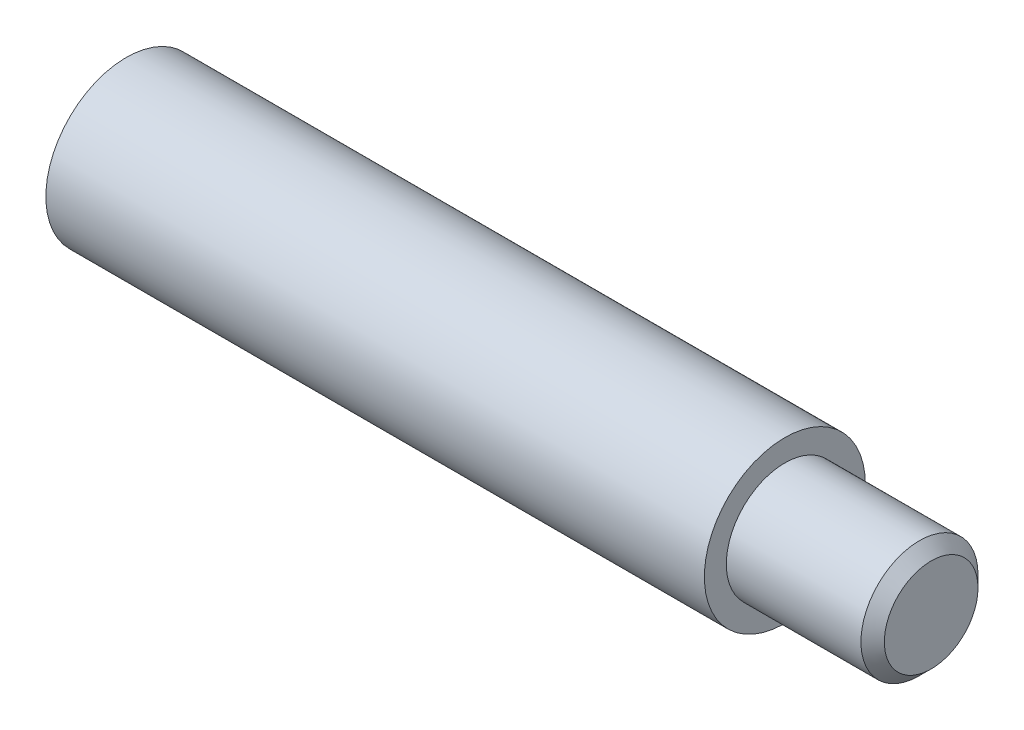
ISO-10303-21;
HEADER;
FILE_DESCRIPTION(('STEP AP214'),'2;1');
FILE_NAME('part.step','',(''),(''),'','','');
FILE_SCHEMA(('AUTOMOTIVE_DESIGN { 1 0 10303 214 1 1 1 1 }'));
ENDSEC;
DATA;
#1=APPLICATION_CONTEXT('core data for automotive mechanical design processes');
#2=APPLICATION_PROTOCOL_DEFINITION('international standard','automotive_design',2000,#1);
#3=PRODUCT_CONTEXT('',#1,'mechanical');
#4=PRODUCT('Part','Part','',(#3));
#5=PRODUCT_RELATED_PRODUCT_CATEGORY('part','',(#4));
#6=PRODUCT_DEFINITION_FORMATION('','',#4);
#7=PRODUCT_DEFINITION_CONTEXT('part definition',#1,'design');
#8=PRODUCT_DEFINITION('design','',#6,#7);
#9=PRODUCT_DEFINITION_SHAPE('','',#8);
#10=(LENGTH_UNIT() NAMED_UNIT(*) SI_UNIT(.MILLI.,.METRE.));
#11=(NAMED_UNIT(*) PLANE_ANGLE_UNIT() SI_UNIT($,.RADIAN.));
#12=(NAMED_UNIT(*) SI_UNIT($,.STERADIAN.) SOLID_ANGLE_UNIT());
#13=UNCERTAINTY_MEASURE_WITH_UNIT(LENGTH_MEASURE(1.E-05),#10,'distance_accuracy_value','');
#14=(GEOMETRIC_REPRESENTATION_CONTEXT(3) GLOBAL_UNCERTAINTY_ASSIGNED_CONTEXT((#13)) GLOBAL_UNIT_ASSIGNED_CONTEXT((#10,
#11,#12)) REPRESENTATION_CONTEXT('',''));
#15=CARTESIAN_POINT('',(0.,0.,0.));
#16=DIRECTION('',(0.,0.,1.));
#17=DIRECTION('',(1.,0.,0.));
#18=AXIS2_PLACEMENT_3D('',#15,#16,#17);
#19=CARTESIAN_POINT('',(-27.5,0.,0.));
#20=DIRECTION('',(1.,0.,0.));
#21=DIRECTION('',(0.,0.,-1.));
#22=AXIS2_PLACEMENT_3D('',#19,#20,#21);
#23=CYLINDRICAL_SURFACE('',#22,2.4585);
#24=CARTESIAN_POINT('',(-15.5,0.,0.));
#25=DIRECTION('',(1.,0.,0.));
#26=DIRECTION('',(0.,0.,-1.));
#27=AXIS2_PLACEMENT_3D('',#24,#25,#26);
#28=CIRCLE('',#27,2.4585);
#29=CARTESIAN_POINT('',(-15.5,0.,-2.4585));
#30=VERTEX_POINT('',#29);
#31=EDGE_CURVE('E11',#30,#30,#28,.T.);
#32=ORIENTED_EDGE('',*,*,#31,.T.);
#33=EDGE_LOOP('',(#32));
#34=FACE_BOUND('',#33,.T.);
#35=CARTESIAN_POINT('',(-26.7,0.,0.));
#36=DIRECTION('',(1.,0.,0.));
#37=DIRECTION('',(0.,0.,-1.));
#38=AXIS2_PLACEMENT_3D('',#35,#36,#37);
#39=CIRCLE('',#38,2.4585);
#40=CARTESIAN_POINT('',(-26.7,0.,-2.4585));
#41=VERTEX_POINT('',#40);
#42=EDGE_CURVE('E51',#41,#41,#39,.T.);
#43=ORIENTED_EDGE('',*,*,#42,.F.);
#44=EDGE_LOOP('',(#43));
#45=FACE_BOUND('',#44,.T.);
#46=ADVANCED_FACE('F32',(#34,#45),#23,.F.);
#47=CARTESIAN_POINT('',(-15.5,0.,0.));
#48=DIRECTION('',(-1.,0.,0.));
#49=DIRECTION('',(0.,0.,1.));
#50=AXIS2_PLACEMENT_3D('',#47,#48,#49);
#51=CONICAL_SURFACE('',#50,2.4585,1.02974425864057);
#52=CARTESIAN_POINT('',(-14.022784168,0.,0.));
#53=VERTEX_POINT('',#52);
#54=VERTEX_LOOP('',#53);
#55=FACE_BOUND('',#54,.T.);
#56=ORIENTED_EDGE('',*,*,#31,.F.);
#57=EDGE_LOOP('',(#56));
#58=FACE_BOUND('',#57,.T.);
#59=ADVANCED_FACE('F41',(#55,#58),#51,.F.);
#60=CARTESIAN_POINT('',(27.5,0.,0.));
#61=DIRECTION('',(1.,0.,0.));
#62=DIRECTION('',(0.,0.,-1.));
#63=AXIS2_PLACEMENT_3D('',#60,#61,#62);
#64=PLANE('',#63);
#65=CARTESIAN_POINT('',(27.5,0.,0.));
#66=DIRECTION('',(1.,0.,0.));
#67=DIRECTION('',(0.,0.,-1.));
#68=AXIS2_PLACEMENT_3D('',#65,#66,#67);
#69=CIRCLE('',#68,3.2);
#70=CARTESIAN_POINT('',(27.5,0.,-3.2));
#71=VERTEX_POINT('',#70);
#72=EDGE_CURVE('E38',#71,#71,#69,.T.);
#73=ORIENTED_EDGE('',*,*,#72,.T.);
#74=EDGE_LOOP('',(#73));
#75=FACE_BOUND('',#74,.T.);
#76=ADVANCED_FACE('F44',(#75),#64,.T.);
#77=CARTESIAN_POINT('',(27.5,0.,0.));
#78=DIRECTION('',(-1.,0.,0.));
#79=DIRECTION('',(0.,0.,1.));
#80=AXIS2_PLACEMENT_3D('',#77,#78,#79);
#81=CONICAL_SURFACE('',#80,3.2,0.785398163397451);
#82=CARTESIAN_POINT('',(26.7,0.,0.));
#83=DIRECTION('',(1.,0.,0.));
#84=DIRECTION('',(0.,0.,-1.));
#85=AXIS2_PLACEMENT_3D('',#82,#83,#84);
#86=CIRCLE('',#85,4.);
#87=CARTESIAN_POINT('',(26.7,0.,-4.));
#88=VERTEX_POINT('',#87);
#89=EDGE_CURVE('E67',#88,#88,#86,.T.);
#90=ORIENTED_EDGE('',*,*,#89,.T.);
#91=EDGE_LOOP('',(#90));
#92=FACE_BOUND('',#91,.T.);
#93=ORIENTED_EDGE('',*,*,#72,.F.);
#94=EDGE_LOOP('',(#93));
#95=FACE_BOUND('',#94,.T.);
#96=ADVANCED_FACE('F73',(#92,#95),#81,.T.);
#97=CARTESIAN_POINT('',(-27.5,0.,0.));
#98=DIRECTION('',(1.,0.,0.));
#99=DIRECTION('',(0.,0.,-1.));
#100=AXIS2_PLACEMENT_3D('',#97,#98,#99);
#101=CYLINDRICAL_SURFACE('',#100,4.);
#102=CARTESIAN_POINT('',(17.5,0.,0.));
#103=DIRECTION('',(1.,0.,0.));
#104=DIRECTION('',(0.,0.,-1.));
#105=AXIS2_PLACEMENT_3D('',#102,#103,#104);
#106=CIRCLE('',#105,4.);
#107=CARTESIAN_POINT('',(17.5,0.,-4.));
#108=VERTEX_POINT('',#107);
#109=EDGE_CURVE('E64',#108,#108,#106,.T.);
#110=ORIENTED_EDGE('',*,*,#109,.T.);
#111=EDGE_LOOP('',(#110));
#112=FACE_BOUND('',#111,.T.);
#113=ORIENTED_EDGE('',*,*,#89,.F.);
#114=EDGE_LOOP('',(#113));
#115=FACE_BOUND('',#114,.T.);
#116=ADVANCED_FACE('F75',(#112,#115),#101,.T.);
#117=CARTESIAN_POINT('',(17.5,4.,0.));
#118=DIRECTION('',(1.,0.,0.));
#119=DIRECTION('',(0.,0.,-1.));
#120=AXIS2_PLACEMENT_3D('',#117,#118,#119);
#121=PLANE('',#120);
#122=CARTESIAN_POINT('',(17.5,0.,0.));
#123=DIRECTION('',(1.,0.,0.));
#124=DIRECTION('',(0.,0.,-1.));
#125=AXIS2_PLACEMENT_3D('',#122,#123,#124);
#126=CIRCLE('',#125,5.5);
#127=CARTESIAN_POINT('',(17.5,0.,-5.5));
#128=VERTEX_POINT('',#127);
#129=EDGE_CURVE('E61',#128,#128,#126,.T.);
#130=ORIENTED_EDGE('',*,*,#129,.T.);
#131=EDGE_LOOP('',(#130));
#132=FACE_BOUND('',#131,.T.);
#133=ORIENTED_EDGE('',*,*,#109,.F.);
#134=EDGE_LOOP('',(#133));
#135=FACE_BOUND('',#134,.T.);
#136=ADVANCED_FACE('F82',(#132,#135),#121,.T.);
#137=CARTESIAN_POINT('',(-27.5,0.,0.));
#138=DIRECTION('',(1.,0.,0.));
#139=DIRECTION('',(0.,0.,-1.));
#140=AXIS2_PLACEMENT_3D('',#137,#138,#139);
#141=CYLINDRICAL_SURFACE('',#140,5.5);
#142=CARTESIAN_POINT('',(-27.5,0.,0.));
#143=DIRECTION('',(1.,0.,0.));
#144=DIRECTION('',(0.,0.,-1.));
#145=AXIS2_PLACEMENT_3D('',#142,#143,#144);
#146=CIRCLE('',#145,5.5);
#147=CARTESIAN_POINT('',(-27.5,0.,-5.5));
#148=VERTEX_POINT('',#147);
#149=EDGE_CURVE('E56',#148,#148,#146,.T.);
#150=ORIENTED_EDGE('',*,*,#149,.T.);
#151=EDGE_LOOP('',(#150));
#152=FACE_BOUND('',#151,.T.);
#153=ORIENTED_EDGE('',*,*,#129,.F.);
#154=EDGE_LOOP('',(#153));
#155=FACE_BOUND('',#154,.T.);
#156=ADVANCED_FACE('F89',(#152,#155),#141,.T.);
#157=CARTESIAN_POINT('',(-27.5,5.5,0.));
#158=DIRECTION('',(-1.,0.,0.));
#159=DIRECTION('',(0.,0.,1.));
#160=AXIS2_PLACEMENT_3D('',#157,#158,#159);
#161=PLANE('',#160);
#162=CARTESIAN_POINT('',(-27.5,0.,0.));
#163=DIRECTION('',(1.,0.,0.));
#164=DIRECTION('',(0.,0.,-1.));
#165=AXIS2_PLACEMENT_3D('',#162,#163,#164);
#166=CIRCLE('',#165,3.25849999999997);
#167=CARTESIAN_POINT('',(-27.5,0.,-3.25849999999997));
#168=VERTEX_POINT('',#167);
#169=EDGE_CURVE('E53',#168,#168,#166,.T.);
#170=ORIENTED_EDGE('',*,*,#169,.T.);
#171=EDGE_LOOP('',(#170));
#172=FACE_BOUND('',#171,.T.);
#173=ORIENTED_EDGE('',*,*,#149,.F.);
#174=EDGE_LOOP('',(#173));
#175=FACE_BOUND('',#174,.T.);
#176=ADVANCED_FACE('F93',(#172,#175),#161,.T.);
#177=CARTESIAN_POINT('',(-27.5,0.,0.));
#178=DIRECTION('',(-1.,0.,0.));
#179=DIRECTION('',(0.,0.,1.));
#180=AXIS2_PLACEMENT_3D('',#177,#178,#179);
#181=CONICAL_SURFACE('',#180,3.25849999999997,0.78539816339745);
#182=ORIENTED_EDGE('',*,*,#42,.T.);
#183=EDGE_LOOP('',(#182));
#184=FACE_BOUND('',#183,.T.);
#185=ORIENTED_EDGE('',*,*,#169,.F.);
#186=EDGE_LOOP('',(#185));
#187=FACE_BOUND('',#186,.T.);
#188=ADVANCED_FACE('F97',(#184,#187),#181,.F.);
#189=CLOSED_SHELL('',(#46,#59,#76,#96,#116,#136,#156,#176,#188));
#190=MANIFOLD_SOLID_BREP('B2',#189);
#191=ADVANCED_BREP_SHAPE_REPRESENTATION('',(#18,#190),#14);
#192=SHAPE_DEFINITION_REPRESENTATION(#9,#191);
ENDSEC;
END-ISO-10303-21;
